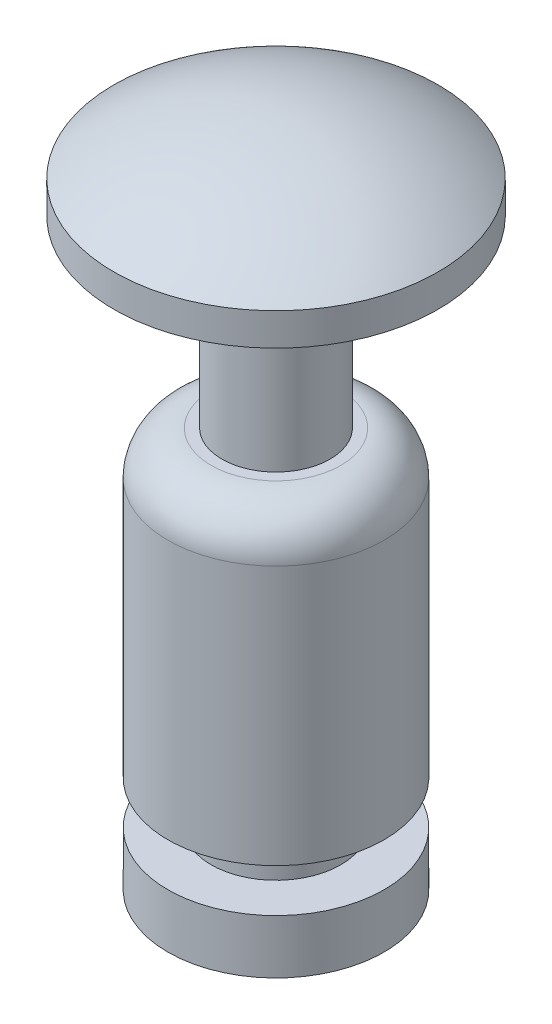
ISO-10303-21;
HEADER;
FILE_DESCRIPTION(('STEP AP214'),'2;1');
FILE_NAME('part.step','',(''),(''),'','','');
FILE_SCHEMA(('AUTOMOTIVE_DESIGN { 1 0 10303 214 1 1 1 1 }'));
ENDSEC;
DATA;
#1=APPLICATION_CONTEXT('core data for automotive mechanical design processes');
#2=APPLICATION_PROTOCOL_DEFINITION('international standard','automotive_design',2000,#1);
#3=PRODUCT_CONTEXT('',#1,'mechanical');
#4=PRODUCT('Part','Part','',(#3));
#5=PRODUCT_RELATED_PRODUCT_CATEGORY('part','',(#4));
#6=PRODUCT_DEFINITION_FORMATION('','',#4);
#7=PRODUCT_DEFINITION_CONTEXT('part definition',#1,'design');
#8=PRODUCT_DEFINITION('design','',#6,#7);
#9=PRODUCT_DEFINITION_SHAPE('','',#8);
#10=(LENGTH_UNIT() NAMED_UNIT(*) SI_UNIT(.MILLI.,.METRE.));
#11=(NAMED_UNIT(*) PLANE_ANGLE_UNIT() SI_UNIT($,.RADIAN.));
#12=(NAMED_UNIT(*) SI_UNIT($,.STERADIAN.) SOLID_ANGLE_UNIT());
#13=UNCERTAINTY_MEASURE_WITH_UNIT(LENGTH_MEASURE(1.E-05),#10,'distance_accuracy_value','');
#14=(GEOMETRIC_REPRESENTATION_CONTEXT(3) GLOBAL_UNCERTAINTY_ASSIGNED_CONTEXT((#13)) GLOBAL_UNIT_ASSIGNED_CONTEXT((#10,
#11,#12)) REPRESENTATION_CONTEXT('',''));
#15=CARTESIAN_POINT('',(0.,0.,0.));
#16=DIRECTION('',(0.,0.,1.));
#17=DIRECTION('',(1.,0.,0.));
#18=AXIS2_PLACEMENT_3D('',#15,#16,#17);
#19=CARTESIAN_POINT('',(0.,5.4,0.));
#20=DIRECTION('',(0.,-1.,0.));
#21=DIRECTION('',(0.,0.,-1.));
#22=AXIS2_PLACEMENT_3D('',#19,#20,#21);
#23=CYLINDRICAL_SURFACE('',#22,1.);
#24=CARTESIAN_POINT('',(0.,3.3,0.));
#25=DIRECTION('',(0.,-1.,0.));
#26=DIRECTION('',(1.,0.,0.));
#27=AXIS2_PLACEMENT_3D('',#24,#25,#26);
#28=CIRCLE('',#27,1.);
#29=CARTESIAN_POINT('',(1.,3.3,0.));
#30=VERTEX_POINT('',#29);
#31=EDGE_CURVE('E44',#30,#30,#28,.T.);
#32=ORIENTED_EDGE('',*,*,#31,.T.);
#33=EDGE_LOOP('',(#32));
#34=FACE_BOUND('',#33,.T.);
#35=CARTESIAN_POINT('',(0.,0.9,0.));
#36=DIRECTION('',(0.,-1.,0.));
#37=DIRECTION('',(1.,0.,0.));
#38=AXIS2_PLACEMENT_3D('',#35,#36,#37);
#39=CIRCLE('',#38,1.);
#40=CARTESIAN_POINT('',(1.,0.9,0.));
#41=VERTEX_POINT('',#40);
#42=EDGE_CURVE('E72',#41,#41,#39,.T.);
#43=ORIENTED_EDGE('',*,*,#42,.F.);
#44=EDGE_LOOP('',(#43));
#45=FACE_BOUND('',#44,.T.);
#46=ADVANCED_FACE('F37',(#34,#45),#23,.T.);
#47=CARTESIAN_POINT('',(0.,0.,0.));
#48=DIRECTION('',(0.,-1.,0.));
#49=DIRECTION('',(1.,0.,0.));
#50=AXIS2_PLACEMENT_3D('',#47,#48,#49);
#51=CYLINDRICAL_SURFACE('',#50,0.6);
#52=CARTESIAN_POINT('',(0.,0.5,0.));
#53=DIRECTION('',(0.,-1.,0.));
#54=DIRECTION('',(1.,0.,0.));
#55=AXIS2_PLACEMENT_3D('',#52,#53,#54);
#56=CIRCLE('',#55,0.6);
#57=CARTESIAN_POINT('',(0.6,0.5,0.));
#58=VERTEX_POINT('',#57);
#59=EDGE_CURVE('E66',#58,#58,#56,.T.);
#60=ORIENTED_EDGE('',*,*,#59,.F.);
#61=EDGE_LOOP('',(#60));
#62=FACE_BOUND('',#61,.T.);
#63=CARTESIAN_POINT('',(0.,0.9,0.));
#64=DIRECTION('',(0.,-1.,0.));
#65=DIRECTION('',(1.,0.,0.));
#66=AXIS2_PLACEMENT_3D('',#63,#64,#65);
#67=CIRCLE('',#66,0.6);
#68=CARTESIAN_POINT('',(0.6,0.9,0.));
#69=VERTEX_POINT('',#68);
#70=EDGE_CURVE('E75',#69,#69,#67,.T.);
#71=ORIENTED_EDGE('',*,*,#70,.T.);
#72=EDGE_LOOP('',(#71));
#73=FACE_BOUND('',#72,.T.);
#74=ADVANCED_FACE('F98',(#62,#73),#51,.T.);
#75=CARTESIAN_POINT('',(0.6,0.5,0.));
#76=DIRECTION('',(0.,-1.,0.));
#77=DIRECTION('',(1.,0.,0.));
#78=AXIS2_PLACEMENT_3D('',#75,#76,#77);
#79=PLANE('',#78);
#80=CARTESIAN_POINT('',(0.,0.5,0.));
#81=DIRECTION('',(0.,-1.,0.));
#82=DIRECTION('',(1.,0.,0.));
#83=AXIS2_PLACEMENT_3D('',#80,#81,#82);
#84=CIRCLE('',#83,1.);
#85=CARTESIAN_POINT('',(1.,0.5,0.));
#86=VERTEX_POINT('',#85);
#87=EDGE_CURVE('E69',#86,#86,#84,.T.);
#88=ORIENTED_EDGE('',*,*,#87,.F.);
#89=EDGE_LOOP('',(#88));
#90=FACE_BOUND('',#89,.T.);
#91=ORIENTED_EDGE('',*,*,#59,.T.);
#92=EDGE_LOOP('',(#91));
#93=FACE_BOUND('',#92,.T.);
#94=ADVANCED_FACE('F104',(#90,#93),#79,.F.);
#95=CARTESIAN_POINT('',(0.6,0.9,0.));
#96=DIRECTION('',(0.,1.,0.));
#97=DIRECTION('',(-1.,0.,0.));
#98=AXIS2_PLACEMENT_3D('',#95,#96,#97);
#99=PLANE('',#98);
#100=ORIENTED_EDGE('',*,*,#70,.F.);
#101=EDGE_LOOP('',(#100));
#102=FACE_BOUND('',#101,.T.);
#103=ORIENTED_EDGE('',*,*,#42,.T.);
#104=EDGE_LOOP('',(#103));
#105=FACE_BOUND('',#104,.T.);
#106=ADVANCED_FACE('F117',(#102,#105),#99,.F.);
#107=CARTESIAN_POINT('',(0.,0.,0.));
#108=DIRECTION('',(0.,1.,0.));
#109=DIRECTION('',(0.,0.,1.));
#110=AXIS2_PLACEMENT_3D('',#107,#108,#109);
#111=PLANE('',#110);
#112=CARTESIAN_POINT('',(0.,0.,0.));
#113=DIRECTION('',(0.,-1.,0.));
#114=DIRECTION('',(0.,0.,-1.));
#115=AXIS2_PLACEMENT_3D('',#112,#113,#114);
#116=CIRCLE('',#115,1.);
#117=CARTESIAN_POINT('',(0.,0.,-1.));
#118=VERTEX_POINT('',#117);
#119=EDGE_CURVE('E61',#118,#118,#116,.T.);
#120=ORIENTED_EDGE('',*,*,#119,.T.);
#121=EDGE_LOOP('',(#120));
#122=FACE_BOUND('',#121,.T.);
#123=ADVANCED_FACE('F109',(#122),#111,.F.);
#124=ORIENTED_EDGE('',*,*,#87,.T.);
#125=EDGE_LOOP('',(#124));
#126=FACE_BOUND('',#125,.T.);
#127=ORIENTED_EDGE('',*,*,#119,.F.);
#128=EDGE_LOOP('',(#127));
#129=FACE_BOUND('',#128,.T.);
#130=ADVANCED_FACE('F100',(#126,#129),#23,.T.);
#131=CARTESIAN_POINT('',(0.,0.,0.));
#132=DIRECTION('',(0.,-1.,0.));
#133=DIRECTION('',(1.,0.,0.));
#134=AXIS2_PLACEMENT_3D('',#131,#132,#133);
#135=CYLINDRICAL_SURFACE('',#134,0.5);
#136=CARTESIAN_POINT('',(0.,3.7,0.));
#137=DIRECTION('',(0.,-1.,0.));
#138=DIRECTION('',(1.,0.,0.));
#139=AXIS2_PLACEMENT_3D('',#136,#137,#138);
#140=CIRCLE('',#139,0.5);
#141=CARTESIAN_POINT('',(0.5,3.7,0.));
#142=VERTEX_POINT('',#141);
#143=EDGE_CURVE('E78',#142,#142,#140,.T.);
#144=ORIENTED_EDGE('',*,*,#143,.F.);
#145=EDGE_LOOP('',(#144));
#146=FACE_BOUND('',#145,.T.);
#147=CARTESIAN_POINT('',(0.,5.4,0.));
#148=DIRECTION('',(0.,-1.,0.));
#149=DIRECTION('',(1.,0.,0.));
#150=AXIS2_PLACEMENT_3D('',#147,#148,#149);
#151=CIRCLE('',#150,0.5);
#152=CARTESIAN_POINT('',(0.5,5.4,0.));
#153=VERTEX_POINT('',#152);
#154=EDGE_CURVE('E81',#153,#153,#151,.T.);
#155=ORIENTED_EDGE('',*,*,#154,.T.);
#156=EDGE_LOOP('',(#155));
#157=FACE_BOUND('',#156,.T.);
#158=ADVANCED_FACE('F85',(#146,#157),#135,.T.);
#159=CARTESIAN_POINT('',(0.5,3.7,0.));
#160=DIRECTION('',(0.,-1.,0.));
#161=DIRECTION('',(1.,0.,0.));
#162=AXIS2_PLACEMENT_3D('',#159,#160,#161);
#163=PLANE('',#162);
#164=CARTESIAN_POINT('',(0.,3.7,0.));
#165=DIRECTION('',(0.,-1.,0.));
#166=DIRECTION('',(1.,0.,0.));
#167=AXIS2_PLACEMENT_3D('',#164,#165,#166);
#168=CIRCLE('',#167,0.6);
#169=CARTESIAN_POINT('',(0.6,3.7,0.));
#170=VERTEX_POINT('',#169);
#171=EDGE_CURVE('E12',#170,#170,#168,.F.);
#172=ORIENTED_EDGE('',*,*,#171,.T.);
#173=EDGE_LOOP('',(#172));
#174=FACE_BOUND('',#173,.T.);
#175=ORIENTED_EDGE('',*,*,#143,.T.);
#176=EDGE_LOOP('',(#175));
#177=FACE_BOUND('',#176,.T.);
#178=ADVANCED_FACE('F51',(#174,#177),#163,.F.);
#179=CARTESIAN_POINT('',(0.,3.7,0.));
#180=DIRECTION('',(0.,1.,0.));
#181=DIRECTION('',(-1.,0.,0.));
#182=AXIS2_PLACEMENT_3D('',#179,#180,#181);
#183=SPHERICAL_SURFACE('',#182,2.5);
#184=CARTESIAN_POINT('',(0.,6.2,0.));
#185=VERTEX_POINT('',#184);
#186=VERTEX_LOOP('',#185);
#187=FACE_BOUND('',#186,.T.);
#188=CARTESIAN_POINT('',(0.,5.7,0.));
#189=DIRECTION('',(0.,1.,0.));
#190=DIRECTION('',(-1.,0.,0.));
#191=AXIS2_PLACEMENT_3D('',#188,#189,#190);
#192=CIRCLE('',#191,1.5);
#193=CARTESIAN_POINT('',(-1.5,5.7,0.));
#194=VERTEX_POINT('',#193);
#195=EDGE_CURVE('E55',#194,#194,#192,.T.);
#196=ORIENTED_EDGE('',*,*,#195,.T.);
#197=EDGE_LOOP('',(#196));
#198=FACE_BOUND('',#197,.T.);
#199=ADVANCED_FACE('F47',(#187,#198),#183,.T.);
#200=CARTESIAN_POINT('',(0.,6.2,0.));
#201=DIRECTION('',(0.,-1.,0.));
#202=DIRECTION('',(0.,0.,-1.));
#203=AXIS2_PLACEMENT_3D('',#200,#201,#202);
#204=CYLINDRICAL_SURFACE('',#203,1.5);
#205=ORIENTED_EDGE('',*,*,#195,.F.);
#206=EDGE_LOOP('',(#205));
#207=FACE_BOUND('',#206,.T.);
#208=CARTESIAN_POINT('',(0.,5.4,0.));
#209=DIRECTION('',(0.,-1.,0.));
#210=DIRECTION('',(0.,0.,-1.));
#211=AXIS2_PLACEMENT_3D('',#208,#209,#210);
#212=CIRCLE('',#211,1.5);
#213=CARTESIAN_POINT('',(0.,5.4,-1.5));
#214=VERTEX_POINT('',#213);
#215=EDGE_CURVE('E57',#214,#214,#212,.T.);
#216=ORIENTED_EDGE('',*,*,#215,.F.);
#217=EDGE_LOOP('',(#216));
#218=FACE_BOUND('',#217,.T.);
#219=ADVANCED_FACE('F50',(#207,#218),#204,.T.);
#220=CARTESIAN_POINT('',(0.,5.4,0.));
#221=DIRECTION('',(0.,-1.,0.));
#222=DIRECTION('',(0.,0.,-1.));
#223=AXIS2_PLACEMENT_3D('',#220,#221,#222);
#224=PLANE('',#223);
#225=ORIENTED_EDGE('',*,*,#215,.T.);
#226=EDGE_LOOP('',(#225));
#227=FACE_BOUND('',#226,.T.);
#228=ORIENTED_EDGE('',*,*,#154,.F.);
#229=EDGE_LOOP('',(#228));
#230=FACE_BOUND('',#229,.T.);
#231=ADVANCED_FACE('F87',(#227,#230),#224,.T.);
#232=CARTESIAN_POINT('',(0.,3.3,0.));
#233=DIRECTION('',(0.,-1.,0.));
#234=DIRECTION('',(1.,0.,0.));
#235=AXIS2_PLACEMENT_3D('',#232,#233,#234);
#236=TOROIDAL_SURFACE('',#235,0.6,0.4);
#237=ORIENTED_EDGE('',*,*,#171,.F.);
#238=EDGE_LOOP('',(#237));
#239=FACE_BOUND('',#238,.T.);
#240=ORIENTED_EDGE('',*,*,#31,.F.);
#241=EDGE_LOOP('',(#240));
#242=FACE_BOUND('',#241,.T.);
#243=ADVANCED_FACE('F39',(#239,#242),#236,.T.);
#244=CLOSED_SHELL('',(#46,#74,#94,#106,#123,#130,#158,#178,#199,#219,#231,#243));
#245=MANIFOLD_SOLID_BREP('B2',#244);
#246=ADVANCED_BREP_SHAPE_REPRESENTATION('',(#18,#245),#14);
#247=SHAPE_DEFINITION_REPRESENTATION(#9,#246);
ENDSEC;
END-ISO-10303-21;
